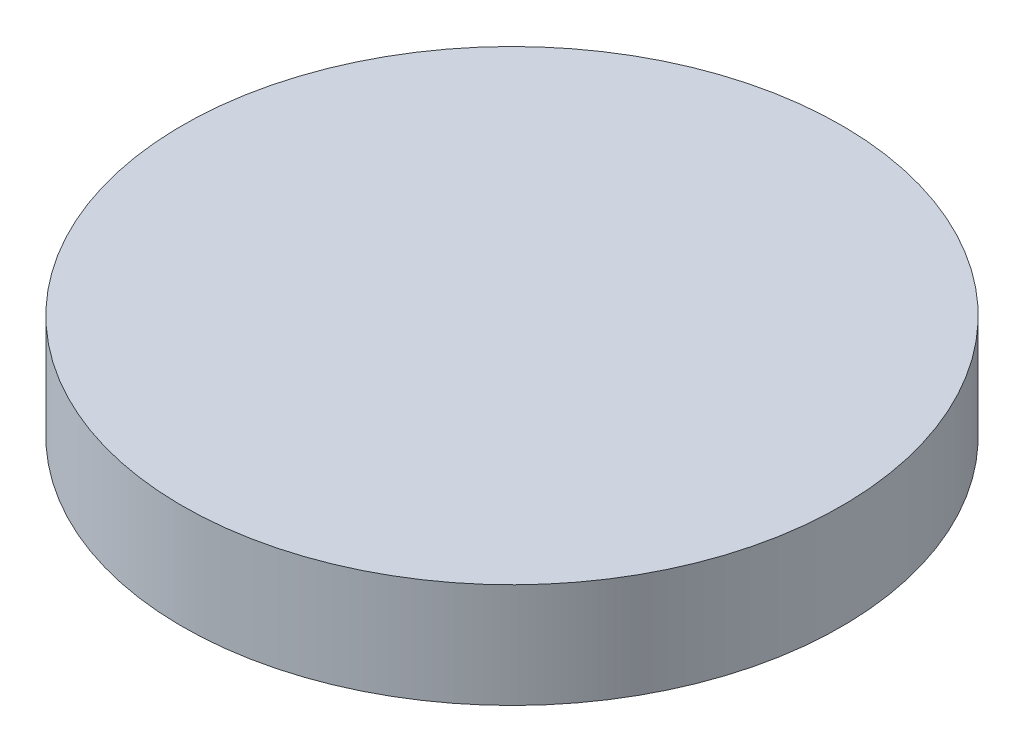
ISO-10303-21;
HEADER;
FILE_DESCRIPTION(('STEP AP214'),'2;1');
FILE_NAME('part.step','',(''),(''),'','','');
FILE_SCHEMA(('AUTOMOTIVE_DESIGN { 1 0 10303 214 1 1 1 1 }'));
ENDSEC;
DATA;
#1=APPLICATION_CONTEXT('core data for automotive mechanical design processes');
#2=APPLICATION_PROTOCOL_DEFINITION('international standard','automotive_design',2000,#1);
#3=PRODUCT_CONTEXT('',#1,'mechanical');
#4=PRODUCT('Part','Part','',(#3));
#5=PRODUCT_RELATED_PRODUCT_CATEGORY('part','',(#4));
#6=PRODUCT_DEFINITION_FORMATION('','',#4);
#7=PRODUCT_DEFINITION_CONTEXT('part definition',#1,'design');
#8=PRODUCT_DEFINITION('design','',#6,#7);
#9=PRODUCT_DEFINITION_SHAPE('','',#8);
#10=(LENGTH_UNIT() NAMED_UNIT(*) SI_UNIT(.MILLI.,.METRE.));
#11=(NAMED_UNIT(*) PLANE_ANGLE_UNIT() SI_UNIT($,.RADIAN.));
#12=(NAMED_UNIT(*) SI_UNIT($,.STERADIAN.) SOLID_ANGLE_UNIT());
#13=UNCERTAINTY_MEASURE_WITH_UNIT(LENGTH_MEASURE(1.E-05),#10,'distance_accuracy_value','');
#14=(GEOMETRIC_REPRESENTATION_CONTEXT(3) GLOBAL_UNCERTAINTY_ASSIGNED_CONTEXT((#13)) GLOBAL_UNIT_ASSIGNED_CONTEXT((#10,
#11,#12)) REPRESENTATION_CONTEXT('',''));
#15=CARTESIAN_POINT('',(0.,0.,0.));
#16=DIRECTION('',(0.,0.,1.));
#17=DIRECTION('',(1.,0.,0.));
#18=AXIS2_PLACEMENT_3D('',#15,#16,#17);
#19=CARTESIAN_POINT('',(0.,-313.,0.));
#20=DIRECTION('',(0.,1.,0.));
#21=DIRECTION('',(-0.546944138603989,0.,0.837169104331222));
#22=AXIS2_PLACEMENT_3D('',#19,#20,#21);
#23=CYLINDRICAL_SURFACE('',#22,268.);
#24=CARTESIAN_POINT('',(0.,-313.,0.));
#25=DIRECTION('',(0.,-1.,0.));
#26=DIRECTION('',(0.837169104331222,0.,0.546944138603989));
#27=AXIS2_PLACEMENT_3D('',#24,#25,#26);
#28=CIRCLE('',#27,268.);
#29=CARTESIAN_POINT('',(224.361319960768,-313.,146.581029145869));
#30=VERTEX_POINT('',#29);
#31=EDGE_CURVE('E10',#30,#30,#28,.T.);
#32=ORIENTED_EDGE('',*,*,#31,.F.);
#33=EDGE_LOOP('',(#32));
#34=FACE_BOUND('',#33,.T.);
#35=CARTESIAN_POINT('',(0.,-228.,0.));
#36=DIRECTION('',(0.,-1.,0.));
#37=DIRECTION('',(0.837169104331222,0.,0.546944138603989));
#38=AXIS2_PLACEMENT_3D('',#35,#36,#37);
#39=CIRCLE('',#38,268.);
#40=CARTESIAN_POINT('',(224.361319960768,-228.,146.581029145869));
#41=VERTEX_POINT('',#40);
#42=EDGE_CURVE('E18',#41,#41,#39,.T.);
#43=ORIENTED_EDGE('',*,*,#42,.T.);
#44=EDGE_LOOP('',(#43));
#45=FACE_BOUND('',#44,.T.);
#46=ADVANCED_FACE('F15',(#34,#45),#23,.T.);
#47=CARTESIAN_POINT('',(0.,-313.,0.));
#48=DIRECTION('',(0.,-1.,0.));
#49=DIRECTION('',(0.546944138603989,0.,-0.837169104331222));
#50=AXIS2_PLACEMENT_3D('',#47,#48,#49);
#51=PLANE('',#50);
#52=ORIENTED_EDGE('',*,*,#31,.T.);
#53=EDGE_LOOP('',(#52));
#54=FACE_BOUND('',#53,.T.);
#55=ADVANCED_FACE('F33',(#54),#51,.T.);
#56=CARTESIAN_POINT('',(0.,-228.,0.));
#57=DIRECTION('',(0.,-1.,0.));
#58=DIRECTION('',(0.546944138603989,0.,-0.837169104331222));
#59=AXIS2_PLACEMENT_3D('',#56,#57,#58);
#60=PLANE('',#59);
#61=ORIENTED_EDGE('',*,*,#42,.F.);
#62=EDGE_LOOP('',(#61));
#63=FACE_BOUND('',#62,.T.);
#64=ADVANCED_FACE('F31',(#63),#60,.F.);
#65=CLOSED_SHELL('',(#46,#55,#64));
#66=MANIFOLD_SOLID_BREP('B1',#65);
#67=ADVANCED_BREP_SHAPE_REPRESENTATION('',(#18,#66),#14);
#68=SHAPE_DEFINITION_REPRESENTATION(#9,#67);
ENDSEC;
END-ISO-10303-21;
